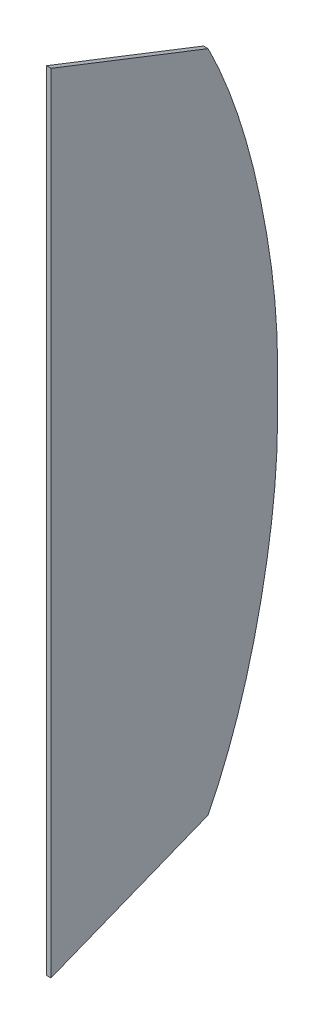
ISO-10303-21;
HEADER;
FILE_DESCRIPTION(('STEP AP214'),'2;1');
FILE_NAME('part.step','',(''),(''),'','','');
FILE_SCHEMA(('AUTOMOTIVE_DESIGN { 1 0 10303 214 1 1 1 1 }'));
ENDSEC;
DATA;
#1=APPLICATION_CONTEXT('core data for automotive mechanical design processes');
#2=APPLICATION_PROTOCOL_DEFINITION('international standard','automotive_design',2000,#1);
#3=PRODUCT_CONTEXT('',#1,'mechanical');
#4=PRODUCT('Part','Part','',(#3));
#5=PRODUCT_RELATED_PRODUCT_CATEGORY('part','',(#4));
#6=PRODUCT_DEFINITION_FORMATION('','',#4);
#7=PRODUCT_DEFINITION_CONTEXT('part definition',#1,'design');
#8=PRODUCT_DEFINITION('design','',#6,#7);
#9=PRODUCT_DEFINITION_SHAPE('','',#8);
#10=(LENGTH_UNIT() NAMED_UNIT(*) SI_UNIT(.MILLI.,.METRE.));
#11=(NAMED_UNIT(*) PLANE_ANGLE_UNIT() SI_UNIT($,.RADIAN.));
#12=(NAMED_UNIT(*) SI_UNIT($,.STERADIAN.) SOLID_ANGLE_UNIT());
#13=UNCERTAINTY_MEASURE_WITH_UNIT(LENGTH_MEASURE(1.E-05),#10,'distance_accuracy_value','');
#14=(GEOMETRIC_REPRESENTATION_CONTEXT(3) GLOBAL_UNCERTAINTY_ASSIGNED_CONTEXT((#13)) GLOBAL_UNIT_ASSIGNED_CONTEXT((#10,
#11,#12)) REPRESENTATION_CONTEXT('',''));
#15=CARTESIAN_POINT('',(0.,0.,0.));
#16=DIRECTION('',(0.,0.,1.));
#17=DIRECTION('',(1.,0.,0.));
#18=AXIS2_PLACEMENT_3D('',#15,#16,#17);
#19=CARTESIAN_POINT('',(6.,-434.591306286478,248.999999691598));
#20=CARTESIAN_POINT('',(6.,-426.266385018669,244.812182663864));
#21=CARTESIAN_POINT('',(6.,-409.423964908326,236.801362844897));
#22=CARTESIAN_POINT('',(6.,-375.149628797293,222.212406313021));
#23=CARTESIAN_POINT('',(6.,-331.259297463056,206.472109959754));
#24=CARTESIAN_POINT('',(6.,-277.308218149153,191.065215125894));
#25=CARTESIAN_POINT('',(6.,-222.427655868533,178.618405136148));
#26=CARTESIAN_POINT('',(6.,-167.061884286646,168.601235655821));
#27=CARTESIAN_POINT('',(6.,-120.681496000962,162.664180797077));
#28=CARTESIAN_POINT('',(6.,-83.4660930358459,159.588454430788));
#29=CARTESIAN_POINT('',(6.,-55.5330096837927,158.191016903717));
#30=CARTESIAN_POINT('',(6.,-27.5061419106363,157.699086860232));
#31=CARTESIAN_POINT('',(6.,0.657149051444837,157.668208507846));
#32=CARTESIAN_POINT('',(6.,28.8204400131948,157.699086883261));
#33=CARTESIAN_POINT('',(6.,56.8473077973295,158.191016915326));
#34=CARTESIAN_POINT('',(6.,84.7803911800562,159.588454358424));
#35=CARTESIAN_POINT('',(6.,121.995794186378,162.664180548182));
#36=CARTESIAN_POINT('',(6.,168.376182512208,168.601235151387));
#37=CARTESIAN_POINT('',(6.,223.741954043314,178.618404527818));
#38=CARTESIAN_POINT('',(6.,278.622516156556,191.065214881807));
#39=CARTESIAN_POINT('',(6.,332.573595341031,206.472110197853));
#40=CARTESIAN_POINT('',(6.,376.463926678336,222.212406757595));
#41=CARTESIAN_POINT('',(6.,410.738262920438,236.801363167192));
#42=CARTESIAN_POINT('',(6.,427.580683135124,244.81218279364));
#43=CARTESIAN_POINT('',(6.,435.905604479438,248.999999691598));
#44=B_SPLINE_CURVE_WITH_KNOTS('',3,(#19,#20,#21,#22,#23,#24,#25,#26,#27,#28,#29,#30,#31,#32,#33,
#34,#35,#36,#37,#38,#39,#40,#41,#42,#43),.UNSPECIFIED.,.F.,.F.,(4,1,1,1,1,1,1,1,1,1,1,1,1,1,1,1,
1,1,1,1,1,1,4),(0.00253448303563442,0.0336260778439174,0.0647176726522003,0.126900862268766,
0.189084051885332,0.251267241501898,0.313450431118464,0.37563362073503,0.406725215543313,
0.437816810351596,0.468908405159879,0.499999999968162,0.531091594776445,0.562183189584728,
0.593274784393011,0.624366379201294,0.68654956881786,0.748732758434425,0.810915948050991,
0.873099137667557,0.935282327284123,0.966373922092406,0.997465516900689),.UNSPECIFIED.);
#45=DIRECTION('',(-1.,0.,0.));
#46=VECTOR('',#45,1.);
#47=SURFACE_OF_LINEAR_EXTRUSION('',#44,#46);
#48=CARTESIAN_POINT('',(0.,-434.591306286478,248.999999691598));
#49=CARTESIAN_POINT('',(0.,-426.266385018669,244.812182663864));
#50=CARTESIAN_POINT('',(0.,-409.423964908326,236.801362844897));
#51=CARTESIAN_POINT('',(0.,-375.149628797293,222.212406313021));
#52=CARTESIAN_POINT('',(0.,-331.259297463056,206.472109959754));
#53=CARTESIAN_POINT('',(0.,-277.308218149153,191.065215125894));
#54=CARTESIAN_POINT('',(0.,-222.427655868533,178.618405136148));
#55=CARTESIAN_POINT('',(0.,-167.061884286646,168.601235655821));
#56=CARTESIAN_POINT('',(0.,-120.681496000962,162.664180797077));
#57=CARTESIAN_POINT('',(0.,-83.4660930358459,159.588454430788));
#58=CARTESIAN_POINT('',(0.,-55.5330096837927,158.191016903717));
#59=CARTESIAN_POINT('',(0.,-27.5061419106363,157.699086860232));
#60=CARTESIAN_POINT('',(0.,0.657149051444837,157.668208507846));
#61=CARTESIAN_POINT('',(0.,28.8204400131948,157.699086883261));
#62=CARTESIAN_POINT('',(0.,56.8473077973295,158.191016915326));
#63=CARTESIAN_POINT('',(0.,84.7803911800562,159.588454358424));
#64=CARTESIAN_POINT('',(0.,121.995794186378,162.664180548182));
#65=CARTESIAN_POINT('',(0.,168.376182512208,168.601235151387));
#66=CARTESIAN_POINT('',(0.,223.741954043314,178.618404527818));
#67=CARTESIAN_POINT('',(0.,278.622516156556,191.065214881807));
#68=CARTESIAN_POINT('',(0.,332.573595341031,206.472110197853));
#69=CARTESIAN_POINT('',(0.,376.463926678336,222.212406757595));
#70=CARTESIAN_POINT('',(0.,410.738262920438,236.801363167192));
#71=CARTESIAN_POINT('',(0.,427.580683135124,244.81218279364));
#72=CARTESIAN_POINT('',(0.,435.905604479438,248.999999691598));
#73=B_SPLINE_CURVE_WITH_KNOTS('',3,(#48,#49,#50,#51,#52,#53,#54,#55,#56,#57,#58,#59,#60,#61,#62,
#63,#64,#65,#66,#67,#68,#69,#70,#71,#72),.UNSPECIFIED.,.F.,.F.,(4,1,1,1,1,1,1,1,1,1,1,1,1,1,1,1,
1,1,1,1,1,1,4),(0.00253448303563442,0.0336260778439174,0.0647176726522003,0.126900862268766,
0.189084051885332,0.251267241501898,0.313450431118464,0.37563362073503,0.406725215543313,
0.437816810351596,0.468908405159879,0.499999999968162,0.531091594776445,0.562183189584728,
0.593274784393011,0.624366379201294,0.68654956881786,0.748732758434425,0.810915948050991,
0.873099137667557,0.935282327284123,0.966373922092406,0.997465516900689),.UNSPECIFIED.);
#74=CARTESIAN_POINT('',(0.,-434.591306286478,248.999999691598));
#75=VERTEX_POINT('',#74);
#76=CARTESIAN_POINT('',(0.,435.905604479438,248.999999691598));
#77=VERTEX_POINT('',#76);
#78=EDGE_CURVE('E96',#75,#77,#73,.T.);
#79=ORIENTED_EDGE('',*,*,#78,.T.);
#80=DIRECTION('',(-1.,0.,0.));
#81=VECTOR('',#80,1.);
#82=CARTESIAN_POINT('',(6.,435.905604479438,248.999999691598));
#83=LINE('',#82,#81);
#84=CARTESIAN_POINT('',(6.,435.905604479438,248.999999691598));
#85=VERTEX_POINT('',#84);
#86=EDGE_CURVE('E11',#85,#77,#83,.T.);
#87=ORIENTED_EDGE('',*,*,#86,.F.);
#88=CARTESIAN_POINT('',(6.,-434.591306286478,248.999999691598));
#89=VERTEX_POINT('',#88);
#90=EDGE_CURVE('E85',#89,#85,#44,.T.);
#91=ORIENTED_EDGE('',*,*,#90,.F.);
#92=DIRECTION('',(-1.,0.,0.));
#93=VECTOR('',#92,1.);
#94=CARTESIAN_POINT('',(6.,-434.591306286478,248.999999691598));
#95=LINE('',#94,#93);
#96=EDGE_CURVE('E93',#89,#75,#95,.T.);
#97=ORIENTED_EDGE('',*,*,#96,.T.);
#98=EDGE_LOOP('',(#79,#87,#91,#97));
#99=FACE_BOUND('',#98,.T.);
#100=ADVANCED_FACE('F33',(#99),#47,.F.);
#101=CARTESIAN_POINT('',(6.,516.556548518137,455.));
#102=DIRECTION('',(0.,-0.931177959031522,0.364564958016935));
#103=DIRECTION('',(0.,-0.364564958016935,-0.931177959031522));
#104=AXIS2_PLACEMENT_3D('',#101,#102,#103);
#105=PLANE('',#104);
#106=DIRECTION('',(0.,0.364564958016935,0.931177959031522));
#107=VECTOR('',#106,1.);
#108=CARTESIAN_POINT('',(0.,516.556548518137,455.));
#109=LINE('',#108,#107);
#110=CARTESIAN_POINT('',(0.,516.556548518137,455.));
#111=VERTEX_POINT('',#110);
#112=EDGE_CURVE('E89',#77,#111,#109,.T.);
#113=ORIENTED_EDGE('',*,*,#112,.T.);
#114=DIRECTION('',(-1.,0.,0.));
#115=VECTOR('',#114,1.);
#116=CARTESIAN_POINT('',(6.,516.556548518137,455.));
#117=LINE('',#116,#115);
#118=CARTESIAN_POINT('',(6.,516.556548518137,455.));
#119=VERTEX_POINT('',#118);
#120=EDGE_CURVE('E42',#119,#111,#117,.T.);
#121=ORIENTED_EDGE('',*,*,#120,.F.);
#122=DIRECTION('',(0.,0.364564958016935,0.931177959031522));
#123=VECTOR('',#122,1.);
#124=CARTESIAN_POINT('',(6.,516.556548518137,455.));
#125=LINE('',#124,#123);
#126=EDGE_CURVE('E80',#85,#119,#125,.T.);
#127=ORIENTED_EDGE('',*,*,#126,.F.);
#128=ORIENTED_EDGE('',*,*,#86,.T.);
#129=EDGE_LOOP('',(#113,#121,#127,#128));
#130=FACE_BOUND('',#129,.T.);
#131=ADVANCED_FACE('F88',(#130),#105,.F.);
#132=CARTESIAN_POINT('',(6.,-516.542644104241,455.));
#133=DIRECTION('',(0.,0.,-1.));
#134=DIRECTION('',(0.,1.,0.));
#135=AXIS2_PLACEMENT_3D('',#132,#133,#134);
#136=PLANE('',#135);
#137=DIRECTION('',(0.,-1.,0.));
#138=VECTOR('',#137,1.);
#139=CARTESIAN_POINT('',(0.,-516.542644104241,455.));
#140=LINE('',#139,#138);
#141=CARTESIAN_POINT('',(0.,-516.542644104241,455.));
#142=VERTEX_POINT('',#141);
#143=EDGE_CURVE('E67',#111,#142,#140,.T.);
#144=ORIENTED_EDGE('',*,*,#143,.T.);
#145=DIRECTION('',(-1.,0.,0.));
#146=VECTOR('',#145,1.);
#147=CARTESIAN_POINT('',(6.,-516.542644104241,455.));
#148=LINE('',#147,#146);
#149=CARTESIAN_POINT('',(6.,-516.542644104241,455.));
#150=VERTEX_POINT('',#149);
#151=EDGE_CURVE('E90',#150,#142,#148,.T.);
#152=ORIENTED_EDGE('',*,*,#151,.F.);
#153=DIRECTION('',(0.,-1.,0.));
#154=VECTOR('',#153,1.);
#155=CARTESIAN_POINT('',(6.,-516.542644104241,455.));
#156=LINE('',#155,#154);
#157=EDGE_CURVE('E83',#119,#150,#156,.T.);
#158=ORIENTED_EDGE('',*,*,#157,.F.);
#159=ORIENTED_EDGE('',*,*,#120,.T.);
#160=EDGE_LOOP('',(#144,#152,#158,#159));
#161=FACE_BOUND('',#160,.T.);
#162=ADVANCED_FACE('F91',(#161),#136,.F.);
#163=CARTESIAN_POINT('',(6.,-516.542644104241,455.));
#164=DIRECTION('',(0.,0.929172883895194,0.369645440704857));
#165=DIRECTION('',(0.,-0.369645440704857,0.929172883895194));
#166=AXIS2_PLACEMENT_3D('',#163,#164,#165);
#167=PLANE('',#166);
#168=DIRECTION('',(0.,0.369645440704857,-0.929172883895194));
#169=VECTOR('',#168,1.);
#170=CARTESIAN_POINT('',(0.,-516.542644104241,455.));
#171=LINE('',#170,#169);
#172=EDGE_CURVE('E73',#142,#75,#171,.T.);
#173=ORIENTED_EDGE('',*,*,#172,.T.);
#174=ORIENTED_EDGE('',*,*,#96,.F.);
#175=DIRECTION('',(0.,0.369645440704857,-0.929172883895194));
#176=VECTOR('',#175,1.);
#177=CARTESIAN_POINT('',(6.,-516.542644104241,455.));
#178=LINE('',#177,#176);
#179=EDGE_CURVE('E50',#150,#89,#178,.T.);
#180=ORIENTED_EDGE('',*,*,#179,.F.);
#181=ORIENTED_EDGE('',*,*,#151,.T.);
#182=EDGE_LOOP('',(#173,#174,#180,#181));
#183=FACE_BOUND('',#182,.T.);
#184=ADVANCED_FACE('F108',(#183),#167,.F.);
#185=CARTESIAN_POINT('',(6.,0.657149051389639,157.678501295813));
#186=DIRECTION('',(1.,0.,0.));
#187=DIRECTION('',(0.,0.,-1.));
#188=AXIS2_PLACEMENT_3D('',#185,#186,#187);
#189=PLANE('',#188);
#190=ORIENTED_EDGE('',*,*,#90,.T.);
#191=ORIENTED_EDGE('',*,*,#126,.T.);
#192=ORIENTED_EDGE('',*,*,#157,.T.);
#193=ORIENTED_EDGE('',*,*,#179,.T.);
#194=EDGE_LOOP('',(#190,#191,#192,#193));
#195=FACE_BOUND('',#194,.T.);
#196=ADVANCED_FACE('F81',(#195),#189,.T.);
#197=CARTESIAN_POINT('',(0.,0.657149051389639,157.678501295813));
#198=DIRECTION('',(1.,0.,0.));
#199=DIRECTION('',(0.,0.,-1.));
#200=AXIS2_PLACEMENT_3D('',#197,#198,#199);
#201=PLANE('',#200);
#202=ORIENTED_EDGE('',*,*,#78,.F.);
#203=ORIENTED_EDGE('',*,*,#172,.F.);
#204=ORIENTED_EDGE('',*,*,#143,.F.);
#205=ORIENTED_EDGE('',*,*,#112,.F.);
#206=EDGE_LOOP('',(#202,#203,#204,#205));
#207=FACE_BOUND('',#206,.T.);
#208=ADVANCED_FACE('F111',(#207),#201,.F.);
#209=CLOSED_SHELL('',(#100,#131,#162,#184,#196,#208));
#210=MANIFOLD_SOLID_BREP('B2',#209);
#211=ADVANCED_BREP_SHAPE_REPRESENTATION('',(#18,#210),#14);
#212=SHAPE_DEFINITION_REPRESENTATION(#9,#211);
ENDSEC;
END-ISO-10303-21;
